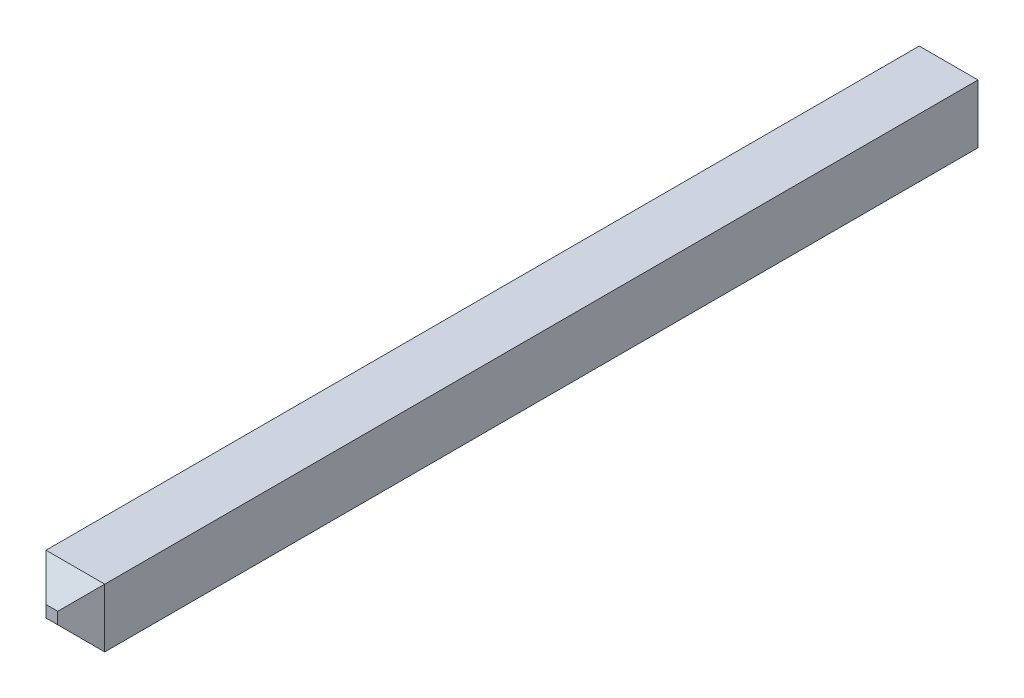
ISO-10303-21;
HEADER;
FILE_DESCRIPTION(('STEP AP214'),'2;1');
FILE_NAME('part.step','',(''),(''),'','','');
FILE_SCHEMA(('AUTOMOTIVE_DESIGN { 1 0 10303 214 1 1 1 1 }'));
ENDSEC;
DATA;
#1=APPLICATION_CONTEXT('core data for automotive mechanical design processes');
#2=APPLICATION_PROTOCOL_DEFINITION('international standard','automotive_design',2000,#1);
#3=PRODUCT_CONTEXT('',#1,'mechanical');
#4=PRODUCT('Part','Part','',(#3));
#5=PRODUCT_RELATED_PRODUCT_CATEGORY('part','',(#4));
#6=PRODUCT_DEFINITION_FORMATION('','',#4);
#7=PRODUCT_DEFINITION_CONTEXT('part definition',#1,'design');
#8=PRODUCT_DEFINITION('design','',#6,#7);
#9=PRODUCT_DEFINITION_SHAPE('','',#8);
#10=(LENGTH_UNIT() NAMED_UNIT(*) SI_UNIT(.MILLI.,.METRE.));
#11=(NAMED_UNIT(*) PLANE_ANGLE_UNIT() SI_UNIT($,.RADIAN.));
#12=(NAMED_UNIT(*) SI_UNIT($,.STERADIAN.) SOLID_ANGLE_UNIT());
#13=UNCERTAINTY_MEASURE_WITH_UNIT(LENGTH_MEASURE(1.E-05),#10,'distance_accuracy_value','');
#14=(GEOMETRIC_REPRESENTATION_CONTEXT(3) GLOBAL_UNCERTAINTY_ASSIGNED_CONTEXT((#13)) GLOBAL_UNIT_ASSIGNED_CONTEXT((#10,
#11,#12)) REPRESENTATION_CONTEXT('',''));
#15=CARTESIAN_POINT('',(0.,0.,0.));
#16=DIRECTION('',(0.,0.,1.));
#17=DIRECTION('',(1.,0.,0.));
#18=AXIS2_PLACEMENT_3D('',#15,#16,#17);
#19=CARTESIAN_POINT('',(1.13197587217093,-0.902265312346261,-0.0505976377952756));
#20=DIRECTION('',(0.,-0.707106781186552,0.707106781186543));
#21=DIRECTION('',(0.,-0.707106781186543,-0.707106781186552));
#22=AXIS2_PLACEMENT_3D('',#19,#20,#21);
#23=PLANE('',#22);
#24=DIRECTION('',(1.,0.,0.));
#25=VECTOR('',#24,1.);
#26=CARTESIAN_POINT('',(1.11898374618668,-0.914666887149411,-0.0629992125984253));
#27=LINE('',#26,#25);
#28=CARTESIAN_POINT('',(1.1127829587851,-0.914666887149411,-0.0629992125984255));
#29=VERTEX_POINT('',#28);
#30=CARTESIAN_POINT('',(1.11868847059613,-0.914666887149411,-0.0629992125984255));
#31=VERTEX_POINT('',#30);
#32=EDGE_CURVE('E109',#29,#31,#27,.T.);
#33=ORIENTED_EDGE('',*,*,#32,.F.);
#34=DIRECTION('',(-0.577350269189552,0.577350269189769,0.577350269189557));
#35=VECTOR('',#34,1.);
#36=CARTESIAN_POINT('',(1.1127829587851,-0.914666887149411,-0.0629992125984255));
#37=LINE('',#36,#35);
#38=CARTESIAN_POINT('',(1.10097193516306,-0.902855863527363,-0.0511881889763784));
#39=VERTEX_POINT('',#38);
#40=EDGE_CURVE('E115',#29,#39,#37,.T.);
#41=ORIENTED_EDGE('',*,*,#40,.T.);
#42=DIRECTION('',(1.,0.,0.));
#43=VECTOR('',#42,1.);
#44=CARTESIAN_POINT('',(1.13197587217093,-0.902855863527363,-0.051188188976378));
#45=LINE('',#44,#43);
#46=CARTESIAN_POINT('',(1.13049949421818,-0.902855863527363,-0.0511881889763776));
#47=VERTEX_POINT('',#46);
#48=EDGE_CURVE('E111',#47,#39,#45,.F.);
#49=ORIENTED_EDGE('',*,*,#48,.F.);
#50=DIRECTION('',(-0.577350269189632,-0.577350269189605,-0.57735026918964));
#51=VECTOR('',#50,1.);
#52=CARTESIAN_POINT('',(1.13049949421818,-0.902855863527363,-0.0511881889763767));
#53=LINE('',#52,#51);
#54=EDGE_CURVE('E79',#47,#31,#53,.T.);
#55=ORIENTED_EDGE('',*,*,#54,.T.);
#56=EDGE_LOOP('',(#33,#41,#49,#55));
#57=FACE_BOUND('',#56,.T.);
#58=ADVANCED_FACE('F17',(#57),#23,.F.);
#59=CARTESIAN_POINT('',(1.0994955572103,-0.915257438330513,0.400189763779528));
#60=DIRECTION('',(0.,0.707106781186543,0.707106781186552));
#61=DIRECTION('',(0.,-0.707106781186552,0.707106781186543));
#62=AXIS2_PLACEMENT_3D('',#59,#60,#61);
#63=PLANE('',#62);
#64=DIRECTION('',(-0.577350269189551,0.577350269189779,-0.577350269189548));
#65=VECTOR('',#64,1.);
#66=CARTESIAN_POINT('',(1.1127829587851,-0.914666887149411,0.399599212598421));
#67=LINE('',#66,#65);
#68=CARTESIAN_POINT('',(1.1127829587851,-0.914666887149411,0.399599212598424));
#69=VERTEX_POINT('',#68);
#70=CARTESIAN_POINT('',(1.10097193516306,-0.902855863527363,0.387788188976378));
#71=VERTEX_POINT('',#70);
#72=EDGE_CURVE('E90',#69,#71,#67,.T.);
#73=ORIENTED_EDGE('',*,*,#72,.F.);
#74=DIRECTION('',(1.,0.,0.));
#75=VECTOR('',#74,1.);
#76=CARTESIAN_POINT('',(1.11898374618668,-0.914666887149411,0.399599212598425));
#77=LINE('',#76,#75);
#78=CARTESIAN_POINT('',(1.11868847059613,-0.914666887149411,0.399599212598426));
#79=VERTEX_POINT('',#78);
#80=EDGE_CURVE('E20',#69,#79,#77,.T.);
#81=ORIENTED_EDGE('',*,*,#80,.T.);
#82=DIRECTION('',(-0.577350269189636,-0.57735026918961,0.577350269189631));
#83=VECTOR('',#82,1.);
#84=CARTESIAN_POINT('',(1.13049949421818,-0.902855863527363,0.387788188976378));
#85=LINE('',#84,#83);
#86=CARTESIAN_POINT('',(1.13049949421818,-0.902855863527363,0.387788188976378));
#87=VERTEX_POINT('',#86);
#88=EDGE_CURVE('E88',#87,#79,#85,.T.);
#89=ORIENTED_EDGE('',*,*,#88,.F.);
#90=DIRECTION('',(1.,0.,0.));
#91=VECTOR('',#90,1.);
#92=CARTESIAN_POINT('',(1.13197587217093,-0.902855863527363,0.387788188976378));
#93=LINE('',#92,#91);
#94=EDGE_CURVE('E113',#71,#87,#93,.T.);
#95=ORIENTED_EDGE('',*,*,#94,.F.);
#96=EDGE_LOOP('',(#73,#81,#89,#95));
#97=FACE_BOUND('',#96,.T.);
#98=ADVANCED_FACE('F86',(#97),#63,.T.);
#99=CARTESIAN_POINT('',(1.11898374618668,-0.920867674550985,0.399599212598425));
#100=DIRECTION('',(0.,0.,-1.));
#101=DIRECTION('',(0.,1.,0.));
#102=AXIS2_PLACEMENT_3D('',#99,#100,#101);
#103=PLANE('',#102);
#104=DIRECTION('',(1.,0.,0.));
#105=VECTOR('',#104,1.);
#106=CARTESIAN_POINT('',(1.0994955572103,-0.920572398960435,0.399599212598426));
#107=LINE('',#106,#105);
#108=CARTESIAN_POINT('',(1.1127829587851,-0.920572398960434,0.399599212598423));
#109=VERTEX_POINT('',#108);
#110=CARTESIAN_POINT('',(1.11868847059613,-0.920572398960434,0.399599212598426));
#111=VERTEX_POINT('',#110);
#112=EDGE_CURVE('E104',#109,#111,#107,.T.);
#113=ORIENTED_EDGE('',*,*,#112,.T.);
#114=DIRECTION('',(0.,1.,0.));
#115=VECTOR('',#114,1.);
#116=CARTESIAN_POINT('',(1.11868847059613,-0.901379485574607,0.399599212598426));
#117=LINE('',#116,#115);
#118=EDGE_CURVE('E94',#79,#111,#117,.F.);
#119=ORIENTED_EDGE('',*,*,#118,.F.);
#120=ORIENTED_EDGE('',*,*,#80,.F.);
#121=DIRECTION('',(0.,1.,0.));
#122=VECTOR('',#121,1.);
#123=CARTESIAN_POINT('',(1.1127829587851,-0.933859800535237,0.399599212598421));
#124=LINE('',#123,#122);
#125=EDGE_CURVE('E121',#109,#69,#124,.T.);
#126=ORIENTED_EDGE('',*,*,#125,.F.);
#127=EDGE_LOOP('',(#113,#119,#120,#126));
#128=FACE_BOUND('',#127,.T.);
#129=ADVANCED_FACE('F102',(#128),#103,.F.);
#130=CARTESIAN_POINT('',(1.11809791941503,-0.901379485574607,0.400189763779528));
#131=DIRECTION('',(0.707106781186544,0.,0.707106781186551));
#132=DIRECTION('',(0.707106781186551,0.,-0.707106781186544));
#133=AXIS2_PLACEMENT_3D('',#130,#131,#132);
#134=PLANE('',#133);
#135=DIRECTION('',(0.,1.,0.));
#136=VECTOR('',#135,1.);
#137=CARTESIAN_POINT('',(1.13049949421818,-0.933859800535237,0.387788188976378));
#138=LINE('',#137,#136);
#139=CARTESIAN_POINT('',(1.13049949421818,-0.932383422582481,0.387788188976378));
#140=VERTEX_POINT('',#139);
#141=EDGE_CURVE('E99',#87,#140,#138,.F.);
#142=ORIENTED_EDGE('',*,*,#141,.F.);
#143=ORIENTED_EDGE('',*,*,#88,.T.);
#144=ORIENTED_EDGE('',*,*,#118,.T.);
#145=DIRECTION('',(0.577350269189726,-0.577350269189577,-0.577350269189575));
#146=VECTOR('',#145,1.);
#147=CARTESIAN_POINT('',(1.11868847059613,-0.920572398960435,0.399599212598426));
#148=LINE('',#147,#146);
#149=EDGE_CURVE('E128',#111,#140,#148,.T.);
#150=ORIENTED_EDGE('',*,*,#149,.T.);
#151=EDGE_LOOP('',(#142,#143,#144,#150));
#152=FACE_BOUND('',#151,.T.);
#153=ADVANCED_FACE('F96',(#152),#134,.T.);
#154=CARTESIAN_POINT('',(1.13109004539928,-0.933859800535237,-0.0505976377952756));
#155=DIRECTION('',(-0.707106781186552,0.,0.707106781186543));
#156=DIRECTION('',(0.707106781186543,0.,0.707106781186552));
#157=AXIS2_PLACEMENT_3D('',#154,#155,#156);
#158=PLANE('',#157);
#159=DIRECTION('',(0.57735026918972,-0.577350269189576,0.577350269189581));
#160=VECTOR('',#159,1.);
#161=CARTESIAN_POINT('',(1.11868847059613,-0.920572398960434,-0.0629992125984256));
#162=LINE('',#161,#160);
#163=CARTESIAN_POINT('',(1.11868847059613,-0.920572398960434,-0.0629992125984255));
#164=VERTEX_POINT('',#163);
#165=CARTESIAN_POINT('',(1.13049949421818,-0.932383422582481,-0.0511881889763774));
#166=VERTEX_POINT('',#165);
#167=EDGE_CURVE('E137',#164,#166,#162,.T.);
#168=ORIENTED_EDGE('',*,*,#167,.F.);
#169=DIRECTION('',(0.,1.,0.));
#170=VECTOR('',#169,1.);
#171=CARTESIAN_POINT('',(1.11868847059613,-0.920867674550985,-0.0629992125984253));
#172=LINE('',#171,#170);
#173=EDGE_CURVE('E107',#31,#164,#172,.F.);
#174=ORIENTED_EDGE('',*,*,#173,.F.);
#175=ORIENTED_EDGE('',*,*,#54,.F.);
#176=DIRECTION('',(0.,1.,0.));
#177=VECTOR('',#176,1.);
#178=CARTESIAN_POINT('',(1.13049949421818,-0.933859800535237,-0.051188188976378));
#179=LINE('',#178,#177);
#180=EDGE_CURVE('E130',#166,#47,#179,.T.);
#181=ORIENTED_EDGE('',*,*,#180,.F.);
#182=EDGE_LOOP('',(#168,#174,#175,#181));
#183=FACE_BOUND('',#182,.T.);
#184=ADVANCED_FACE('F206',(#183),#158,.F.);
#185=CARTESIAN_POINT('',(1.11898374618668,-0.920867674550985,-0.0629992125984253));
#186=DIRECTION('',(0.,0.,-1.));
#187=DIRECTION('',(0.,1.,0.));
#188=AXIS2_PLACEMENT_3D('',#185,#186,#187);
#189=PLANE('',#188);
#190=DIRECTION('',(0.,1.,0.));
#191=VECTOR('',#190,1.);
#192=CARTESIAN_POINT('',(1.1127829587851,-0.901379485574607,-0.0629992125984255));
#193=LINE('',#192,#191);
#194=CARTESIAN_POINT('',(1.1127829587851,-0.920572398960434,-0.0629992125984255));
#195=VERTEX_POINT('',#194);
#196=EDGE_CURVE('E118',#195,#29,#193,.T.);
#197=ORIENTED_EDGE('',*,*,#196,.T.);
#198=ORIENTED_EDGE('',*,*,#32,.T.);
#199=ORIENTED_EDGE('',*,*,#173,.T.);
#200=DIRECTION('',(1.,0.,0.));
#201=VECTOR('',#200,1.);
#202=CARTESIAN_POINT('',(1.13197587217093,-0.920572398960434,-0.0629992125984256));
#203=LINE('',#202,#201);
#204=EDGE_CURVE('E142',#195,#164,#203,.T.);
#205=ORIENTED_EDGE('',*,*,#204,.F.);
#206=EDGE_LOOP('',(#197,#198,#199,#205));
#207=FACE_BOUND('',#206,.T.);
#208=ADVANCED_FACE('F202',(#207),#189,.T.);
#209=CARTESIAN_POINT('',(1.13197587217093,-0.902855863527363,0.152158267716535));
#210=DIRECTION('',(0.,1.,0.));
#211=DIRECTION('',(0.,0.,1.));
#212=AXIS2_PLACEMENT_3D('',#209,#210,#211);
#213=PLANE('',#212);
#214=DIRECTION('',(0.,0.,1.));
#215=VECTOR('',#214,1.);
#216=CARTESIAN_POINT('',(1.10097193516306,-0.902855863527363,0.152158267716535));
#217=LINE('',#216,#215);
#218=EDGE_CURVE('E145',#71,#39,#217,.F.);
#219=ORIENTED_EDGE('',*,*,#218,.F.);
#220=ORIENTED_EDGE('',*,*,#94,.T.);
#221=DIRECTION('',(0.,0.,1.));
#222=VECTOR('',#221,1.);
#223=CARTESIAN_POINT('',(1.13049949421818,-0.902855863527363,0.152158267716535));
#224=LINE('',#223,#222);
#225=EDGE_CURVE('E133',#47,#87,#224,.T.);
#226=ORIENTED_EDGE('',*,*,#225,.F.);
#227=ORIENTED_EDGE('',*,*,#48,.T.);
#228=EDGE_LOOP('',(#219,#220,#226,#227));
#229=FACE_BOUND('',#228,.T.);
#230=ADVANCED_FACE('F198',(#229),#213,.T.);
#231=CARTESIAN_POINT('',(1.10038138398195,-0.901379485574607,-0.0505976377952756));
#232=DIRECTION('',(0.707106781186552,0.,0.707106781186543));
#233=DIRECTION('',(0.707106781186543,0.,-0.707106781186552));
#234=AXIS2_PLACEMENT_3D('',#231,#232,#233);
#235=PLANE('',#234);
#236=DIRECTION('',(0.577350269189387,0.577350269189743,-0.577350269189747));
#237=VECTOR('',#236,1.);
#238=CARTESIAN_POINT('',(1.10097193516306,-0.932383422582481,-0.0511881889763783));
#239=LINE('',#238,#237);
#240=CARTESIAN_POINT('',(1.10097193516306,-0.932383422582481,-0.05118818897638));
#241=VERTEX_POINT('',#240);
#242=EDGE_CURVE('E139',#241,#195,#239,.T.);
#243=ORIENTED_EDGE('',*,*,#242,.F.);
#244=DIRECTION('',(0.,-1.,0.));
#245=VECTOR('',#244,1.);
#246=CARTESIAN_POINT('',(1.10097193516306,-0.901379485574607,-0.051188188976378));
#247=LINE('',#246,#245);
#248=EDGE_CURVE('E34',#39,#241,#247,.T.);
#249=ORIENTED_EDGE('',*,*,#248,.F.);
#250=ORIENTED_EDGE('',*,*,#40,.F.);
#251=ORIENTED_EDGE('',*,*,#196,.F.);
#252=EDGE_LOOP('',(#243,#249,#250,#251));
#253=FACE_BOUND('',#252,.T.);
#254=ADVANCED_FACE('F195',(#253),#235,.F.);
#255=CARTESIAN_POINT('',(1.11337350996621,-0.933859800535237,0.400189763779528));
#256=DIRECTION('',(-0.707106781186544,0.,0.707106781186551));
#257=DIRECTION('',(0.707106781186551,0.,0.707106781186544));
#258=AXIS2_PLACEMENT_3D('',#255,#256,#257);
#259=PLANE('',#258);
#260=ORIENTED_EDGE('',*,*,#125,.T.);
#261=ORIENTED_EDGE('',*,*,#72,.T.);
#262=DIRECTION('',(0.,-1.,0.));
#263=VECTOR('',#262,1.);
#264=CARTESIAN_POINT('',(1.10097193516306,-0.901379485574607,0.387788188976378));
#265=LINE('',#264,#263);
#266=CARTESIAN_POINT('',(1.10097193516306,-0.932383422582481,0.387788188976378));
#267=VERTEX_POINT('',#266);
#268=EDGE_CURVE('E148',#267,#71,#265,.F.);
#269=ORIENTED_EDGE('',*,*,#268,.F.);
#270=DIRECTION('',(0.577350269189393,0.577350269189743,0.577350269189741));
#271=VECTOR('',#270,1.);
#272=CARTESIAN_POINT('',(1.10097193516306,-0.932383422582482,0.387788188976379));
#273=LINE('',#272,#271);
#274=EDGE_CURVE('E124',#267,#109,#273,.T.);
#275=ORIENTED_EDGE('',*,*,#274,.T.);
#276=EDGE_LOOP('',(#260,#261,#269,#275));
#277=FACE_BOUND('',#276,.T.);
#278=ADVANCED_FACE('F176',(#277),#259,.T.);
#279=CARTESIAN_POINT('',(1.0994955572103,-0.919981847779332,0.400189763779528));
#280=DIRECTION('',(0.,0.707106781186544,-0.707106781186551));
#281=DIRECTION('',(0.,0.707106781186551,0.707106781186544));
#282=AXIS2_PLACEMENT_3D('',#279,#280,#281);
#283=PLANE('',#282);
#284=ORIENTED_EDGE('',*,*,#112,.F.);
#285=ORIENTED_EDGE('',*,*,#274,.F.);
#286=DIRECTION('',(1.,0.,0.));
#287=VECTOR('',#286,1.);
#288=CARTESIAN_POINT('',(1.13197587217093,-0.932383422582481,0.387788188976378));
#289=LINE('',#288,#287);
#290=EDGE_CURVE('E151',#267,#140,#289,.T.);
#291=ORIENTED_EDGE('',*,*,#290,.T.);
#292=ORIENTED_EDGE('',*,*,#149,.F.);
#293=EDGE_LOOP('',(#284,#285,#291,#292));
#294=FACE_BOUND('',#293,.T.);
#295=ADVANCED_FACE('F173',(#294),#283,.F.);
#296=CARTESIAN_POINT('',(1.13049949421818,-0.933859800535237,0.152158267716535));
#297=DIRECTION('',(1.,0.,0.));
#298=DIRECTION('',(0.,1.,0.));
#299=AXIS2_PLACEMENT_3D('',#296,#297,#298);
#300=PLANE('',#299);
#301=ORIENTED_EDGE('',*,*,#225,.T.);
#302=ORIENTED_EDGE('',*,*,#141,.T.);
#303=DIRECTION('',(0.,0.,1.));
#304=VECTOR('',#303,1.);
#305=CARTESIAN_POINT('',(1.13049949421818,-0.932383422582481,0.152158267716535));
#306=LINE('',#305,#304);
#307=EDGE_CURVE('E154',#140,#166,#306,.F.);
#308=ORIENTED_EDGE('',*,*,#307,.T.);
#309=ORIENTED_EDGE('',*,*,#180,.T.);
#310=EDGE_LOOP('',(#301,#302,#308,#309));
#311=FACE_BOUND('',#310,.T.);
#312=ADVANCED_FACE('F170',(#311),#300,.T.);
#313=CARTESIAN_POINT('',(1.13197587217093,-0.932973973763584,-0.0505976377952756));
#314=DIRECTION('',(0.,-0.707106781186551,-0.707106781186544));
#315=DIRECTION('',(0.,0.707106781186544,-0.707106781186551));
#316=AXIS2_PLACEMENT_3D('',#313,#314,#315);
#317=PLANE('',#316);
#318=ORIENTED_EDGE('',*,*,#242,.T.);
#319=ORIENTED_EDGE('',*,*,#204,.T.);
#320=ORIENTED_EDGE('',*,*,#167,.T.);
#321=DIRECTION('',(1.,0.,0.));
#322=VECTOR('',#321,1.);
#323=CARTESIAN_POINT('',(1.13197587217093,-0.932383422582481,-0.051188188976378));
#324=LINE('',#323,#322);
#325=EDGE_CURVE('E26',#166,#241,#324,.F.);
#326=ORIENTED_EDGE('',*,*,#325,.T.);
#327=EDGE_LOOP('',(#318,#319,#320,#326));
#328=FACE_BOUND('',#327,.T.);
#329=ADVANCED_FACE('F160',(#328),#317,.T.);
#330=CARTESIAN_POINT('',(1.10097193516306,-0.901379485574607,0.152158267716535));
#331=DIRECTION('',(-1.,0.,0.));
#332=DIRECTION('',(0.,-1.,0.));
#333=AXIS2_PLACEMENT_3D('',#330,#331,#332);
#334=PLANE('',#333);
#335=DIRECTION('',(0.,0.,1.));
#336=VECTOR('',#335,1.);
#337=CARTESIAN_POINT('',(1.10097193516306,-0.932383422582481,0.152158267716535));
#338=LINE('',#337,#336);
#339=EDGE_CURVE('E11',#241,#267,#338,.T.);
#340=ORIENTED_EDGE('',*,*,#339,.T.);
#341=ORIENTED_EDGE('',*,*,#268,.T.);
#342=ORIENTED_EDGE('',*,*,#218,.T.);
#343=ORIENTED_EDGE('',*,*,#248,.T.);
#344=EDGE_LOOP('',(#340,#341,#342,#343));
#345=FACE_BOUND('',#344,.T.);
#346=ADVANCED_FACE('F178',(#345),#334,.T.);
#347=CARTESIAN_POINT('',(1.13197587217093,-0.932383422582481,0.152158267716535));
#348=DIRECTION('',(0.,1.,0.));
#349=DIRECTION('',(0.,0.,1.));
#350=AXIS2_PLACEMENT_3D('',#347,#348,#349);
#351=PLANE('',#350);
#352=ORIENTED_EDGE('',*,*,#325,.F.);
#353=ORIENTED_EDGE('',*,*,#307,.F.);
#354=ORIENTED_EDGE('',*,*,#290,.F.);
#355=ORIENTED_EDGE('',*,*,#339,.F.);
#356=EDGE_LOOP('',(#352,#353,#354,#355));
#357=FACE_BOUND('',#356,.T.);
#358=ADVANCED_FACE('F167',(#357),#351,.F.);
#359=CLOSED_SHELL('',(#58,#98,#129,#153,#184,#208,#230,#254,#278,#295,#312,#329,#346,#358));
#360=MANIFOLD_SOLID_BREP('B1',#359);
#361=ADVANCED_BREP_SHAPE_REPRESENTATION('',(#18,#360),#14);
#362=SHAPE_DEFINITION_REPRESENTATION(#9,#361);
ENDSEC;
END-ISO-10303-21;
